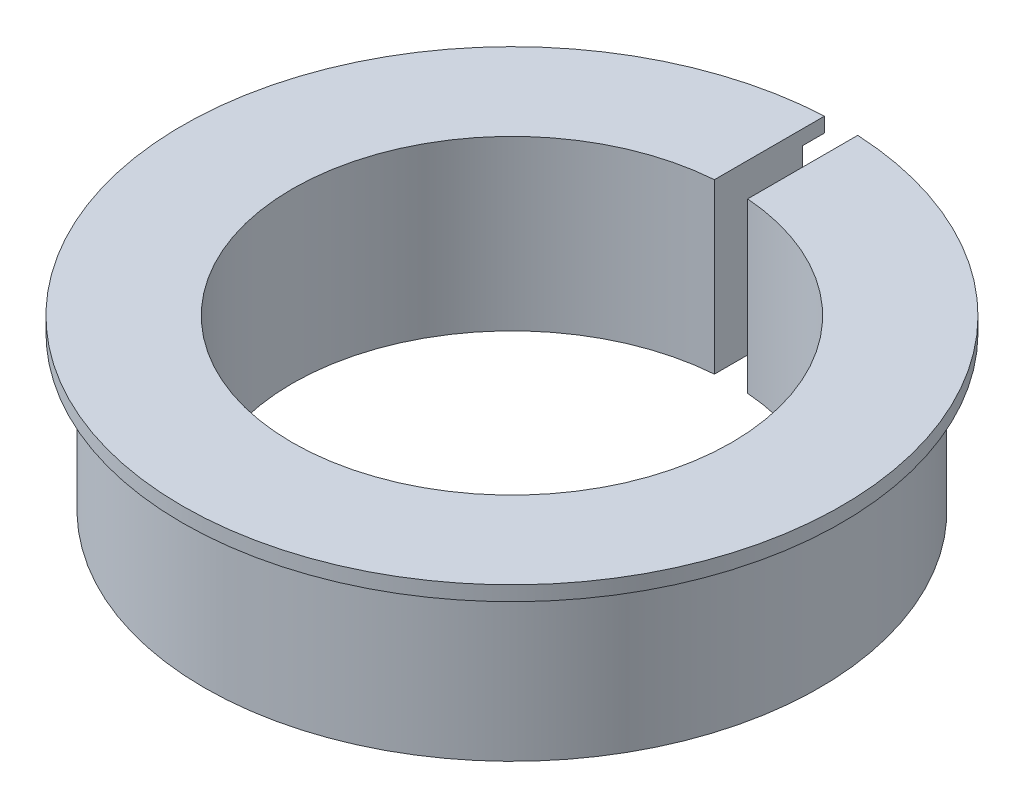
ISO-10303-21;
HEADER;
FILE_DESCRIPTION(('STEP AP214'),'2;1');
FILE_NAME('part.step','',(''),(''),'','','');
FILE_SCHEMA(('AUTOMOTIVE_DESIGN { 1 0 10303 214 1 1 1 1 }'));
ENDSEC;
DATA;
#1=APPLICATION_CONTEXT('core data for automotive mechanical design processes');
#2=APPLICATION_PROTOCOL_DEFINITION('international standard','automotive_design',2000,#1);
#3=PRODUCT_CONTEXT('',#1,'mechanical');
#4=PRODUCT('Part','Part','',(#3));
#5=PRODUCT_RELATED_PRODUCT_CATEGORY('part','',(#4));
#6=PRODUCT_DEFINITION_FORMATION('','',#4);
#7=PRODUCT_DEFINITION_CONTEXT('part definition',#1,'design');
#8=PRODUCT_DEFINITION('design','',#6,#7);
#9=PRODUCT_DEFINITION_SHAPE('','',#8);
#10=(LENGTH_UNIT() NAMED_UNIT(*) SI_UNIT(.MILLI.,.METRE.));
#11=(NAMED_UNIT(*) PLANE_ANGLE_UNIT() SI_UNIT($,.RADIAN.));
#12=(NAMED_UNIT(*) SI_UNIT($,.STERADIAN.) SOLID_ANGLE_UNIT());
#13=UNCERTAINTY_MEASURE_WITH_UNIT(LENGTH_MEASURE(1.E-05),#10,'distance_accuracy_value','');
#14=(GEOMETRIC_REPRESENTATION_CONTEXT(3) GLOBAL_UNCERTAINTY_ASSIGNED_CONTEXT((#13)) GLOBAL_UNIT_ASSIGNED_CONTEXT((#10,
#11,#12)) REPRESENTATION_CONTEXT('',''));
#15=CARTESIAN_POINT('',(0.,0.,0.));
#16=DIRECTION('',(0.,0.,1.));
#17=DIRECTION('',(1.,0.,0.));
#18=AXIS2_PLACEMENT_3D('',#15,#16,#17);
#19=CARTESIAN_POINT('',(0.,21.,0.));
#20=DIRECTION('',(0.,-1.,0.));
#21=DIRECTION('',(0.,0.,-1.));
#22=AXIS2_PLACEMENT_3D('',#19,#20,#21);
#23=CYLINDRICAL_SURFACE('',#22,42.);
#24=CARTESIAN_POINT('',(0.,0.,0.));
#25=DIRECTION('',(0.,1.,0.));
#26=DIRECTION('',(0.,0.,1.));
#27=AXIS2_PLACEMENT_3D('',#24,#25,#26);
#28=CIRCLE('',#27,42.);
#29=CARTESIAN_POINT('',(-2.26543034293681,0.,-41.9388581790361));
#30=VERTEX_POINT('',#29);
#31=CARTESIAN_POINT('',(2.27422361505894,0.,-41.9383822643257));
#32=VERTEX_POINT('',#31);
#33=EDGE_CURVE('E93',#30,#32,#28,.T.);
#34=ORIENTED_EDGE('',*,*,#33,.T.);
#35=DIRECTION('',(0.,-1.,0.));
#36=VECTOR('',#35,1.);
#37=CARTESIAN_POINT('',(2.27422361505894,21.,-41.9383822643257));
#38=LINE('',#37,#36);
#39=CARTESIAN_POINT('',(2.27422361505894,21.,-41.9383822643257));
#40=VERTEX_POINT('',#39);
#41=EDGE_CURVE('E11',#40,#32,#38,.T.);
#42=ORIENTED_EDGE('',*,*,#41,.F.);
#43=CARTESIAN_POINT('',(0.,21.,0.));
#44=DIRECTION('',(0.,1.,0.));
#45=DIRECTION('',(0.,0.,1.));
#46=AXIS2_PLACEMENT_3D('',#43,#44,#45);
#47=CIRCLE('',#46,42.);
#48=CARTESIAN_POINT('',(-2.26543034293681,21.,-41.9388581790361));
#49=VERTEX_POINT('',#48);
#50=EDGE_CURVE('E87',#49,#40,#47,.T.);
#51=ORIENTED_EDGE('',*,*,#50,.F.);
#52=DIRECTION('',(0.,-1.,0.));
#53=VECTOR('',#52,1.);
#54=CARTESIAN_POINT('',(-2.26543034293681,21.,-41.9388581790361));
#55=LINE('',#54,#53);
#56=EDGE_CURVE('E59',#49,#30,#55,.T.);
#57=ORIENTED_EDGE('',*,*,#56,.T.);
#58=EDGE_LOOP('',(#34,#42,#51,#57));
#59=FACE_BOUND('',#58,.T.);
#60=ADVANCED_FACE('F33',(#59),#23,.T.);
#61=CARTESIAN_POINT('',(2.27422361505894,21.,-29.9143414662817));
#62=DIRECTION('',(1.,0.,0.));
#63=DIRECTION('',(0.,0.,-1.));
#64=AXIS2_PLACEMENT_3D('',#61,#62,#63);
#65=PLANE('',#64);
#66=DIRECTION('',(0.,0.,1.));
#67=VECTOR('',#66,1.);
#68=CARTESIAN_POINT('',(2.27422361505894,0.,-29.9143414662817));
#69=LINE('',#68,#67);
#70=CARTESIAN_POINT('',(2.27422361505894,0.,-29.9143414662817));
#71=VERTEX_POINT('',#70);
#72=EDGE_CURVE('E100',#32,#71,#69,.T.);
#73=ORIENTED_EDGE('',*,*,#72,.T.);
#74=DIRECTION('',(0.,-1.,0.));
#75=VECTOR('',#74,1.);
#76=CARTESIAN_POINT('',(2.27422361505894,21.,-29.9143414662817));
#77=LINE('',#76,#75);
#78=CARTESIAN_POINT('',(2.27418578990196,21.,-29.9138439274053));
#79=VERTEX_POINT('',#78);
#80=EDGE_CURVE('E42',#79,#71,#77,.T.);
#81=ORIENTED_EDGE('',*,*,#80,.F.);
#82=CARTESIAN_POINT('',(2.27417318151629,23.,-29.9136780811132));
#83=DIRECTION('',(0.,-1.,0.));
#84=VECTOR('',#83,1.);
#85=LINE('',#82,#84);
#86=CARTESIAN_POINT('',(2.27419839828762,23.,-29.9140097736974));
#87=VERTEX_POINT('',#86);
#88=EDGE_CURVE('E132',#87,#79,#85,.T.);
#89=ORIENTED_EDGE('',*,*,#88,.F.);
#90=DIRECTION('',(0.,0.,-1.));
#91=VECTOR('',#90,1.);
#92=CARTESIAN_POINT('',(2.27422361505894,23.,0.));
#93=LINE('',#92,#91);
#94=CARTESIAN_POINT('',(2.27422361505894,23.,-44.9424955576424));
#95=VERTEX_POINT('',#94);
#96=EDGE_CURVE('E210',#87,#95,#93,.T.);
#97=ORIENTED_EDGE('',*,*,#96,.T.);
#98=DIRECTION('',(0.,-1.,0.));
#99=VECTOR('',#98,1.);
#100=CARTESIAN_POINT('',(2.27422361505894,23.,-44.9424955576424));
#101=LINE('',#100,#99);
#102=CARTESIAN_POINT('',(2.27422361505894,21.,-44.9424955576424));
#103=VERTEX_POINT('',#102);
#104=EDGE_CURVE('E106',#95,#103,#101,.T.);
#105=ORIENTED_EDGE('',*,*,#104,.T.);
#106=DIRECTION('',(0.,0.,-1.));
#107=VECTOR('',#106,1.);
#108=CARTESIAN_POINT('',(2.27422361505894,21.,0.));
#109=LINE('',#108,#107);
#110=EDGE_CURVE('E194',#40,#103,#109,.T.);
#111=ORIENTED_EDGE('',*,*,#110,.F.);
#112=ORIENTED_EDGE('',*,*,#41,.T.);
#113=EDGE_LOOP('',(#73,#81,#89,#97,#105,#111,#112));
#114=FACE_BOUND('',#113,.T.);
#115=ADVANCED_FACE('F149',(#114),#65,.F.);
#116=CARTESIAN_POINT('',(2.26543034293684,21.,-29.9143414662817));
#117=DIRECTION('',(0.,0.,1.));
#118=DIRECTION('',(1.,0.,0.));
#119=AXIS2_PLACEMENT_3D('',#116,#117,#118);
#120=PLANE('',#119);
#121=DIRECTION('',(-1.,0.,0.));
#122=VECTOR('',#121,1.);
#123=CARTESIAN_POINT('',(2.26543034293684,0.,-29.9143414662817));
#124=LINE('',#123,#122);
#125=CARTESIAN_POINT('',(2.26543034293684,0.,-29.9143414662817));
#126=VERTEX_POINT('',#125);
#127=EDGE_CURVE('E103',#71,#126,#124,.T.);
#128=ORIENTED_EDGE('',*,*,#127,.T.);
#129=DIRECTION('',(0.,-1.,0.));
#130=VECTOR('',#129,1.);
#131=CARTESIAN_POINT('',(2.26543034293684,21.,-29.9143414662817));
#132=LINE('',#131,#130);
#133=CARTESIAN_POINT('',(2.26543034293684,21.,-29.9143414662817));
#134=VERTEX_POINT('',#133);
#135=EDGE_CURVE('E115',#134,#126,#132,.T.);
#136=ORIENTED_EDGE('',*,*,#135,.F.);
#137=DIRECTION('',(-1.,0.,0.));
#138=VECTOR('',#137,1.);
#139=CARTESIAN_POINT('',(2.26543034293684,21.,-29.9143414662817));
#140=LINE('',#139,#138);
#141=EDGE_CURVE('E50',#79,#134,#140,.T.);
#142=ORIENTED_EDGE('',*,*,#141,.F.);
#143=ORIENTED_EDGE('',*,*,#80,.T.);
#144=EDGE_LOOP('',(#128,#136,#142,#143));
#145=FACE_BOUND('',#144,.T.);
#146=ADVANCED_FACE('F146',(#145),#120,.F.);
#147=CARTESIAN_POINT('',(0.,21.,0.));
#148=DIRECTION('',(0.,-1.,0.));
#149=DIRECTION('',(0.,0.,-1.));
#150=AXIS2_PLACEMENT_3D('',#147,#148,#149);
#151=CYLINDRICAL_SURFACE('',#150,30.);
#152=CARTESIAN_POINT('',(0.,0.,0.));
#153=DIRECTION('',(0.,-1.,0.));
#154=DIRECTION('',(0.,0.,1.));
#155=AXIS2_PLACEMENT_3D('',#152,#153,#154);
#156=CIRCLE('',#155,30.);
#157=CARTESIAN_POINT('',(-2.2654303429368,0.,-29.9143414662817));
#158=VERTEX_POINT('',#157);
#159=EDGE_CURVE('E88',#126,#158,#156,.T.);
#160=ORIENTED_EDGE('',*,*,#159,.T.);
#161=DIRECTION('',(0.,-1.,0.));
#162=VECTOR('',#161,1.);
#163=CARTESIAN_POINT('',(-2.2654303429368,21.,-29.9143414662817));
#164=LINE('',#163,#162);
#165=CARTESIAN_POINT('',(-2.26543034293681,23.,-29.9143414662817));
#166=VERTEX_POINT('',#165);
#167=EDGE_CURVE('E83',#166,#158,#164,.T.);
#168=ORIENTED_EDGE('',*,*,#167,.F.);
#169=CARTESIAN_POINT('',(0.,23.,0.));
#170=DIRECTION('',(0.,1.,0.));
#171=DIRECTION('',(0.,0.,1.));
#172=AXIS2_PLACEMENT_3D('',#169,#170,#171);
#173=CIRCLE('',#172,30.);
#174=EDGE_CURVE('E191',#87,#166,#173,.F.);
#175=ORIENTED_EDGE('',*,*,#174,.F.);
#176=ORIENTED_EDGE('',*,*,#88,.T.);
#177=CARTESIAN_POINT('',(0.,21.,0.));
#178=DIRECTION('',(0.,-1.,0.));
#179=DIRECTION('',(0.,0.,1.));
#180=AXIS2_PLACEMENT_3D('',#177,#178,#179);
#181=CIRCLE('',#180,30.);
#182=EDGE_CURVE('E96',#134,#79,#181,.T.);
#183=ORIENTED_EDGE('',*,*,#182,.F.);
#184=ORIENTED_EDGE('',*,*,#135,.T.);
#185=EDGE_LOOP('',(#160,#168,#175,#176,#183,#184));
#186=FACE_BOUND('',#185,.T.);
#187=ADVANCED_FACE('F136',(#186),#151,.F.);
#188=CARTESIAN_POINT('',(-2.26543034293681,21.,-29.9143414662817));
#189=DIRECTION('',(-1.,0.,0.));
#190=DIRECTION('',(0.,0.,1.));
#191=AXIS2_PLACEMENT_3D('',#188,#189,#190);
#192=PLANE('',#191);
#193=DIRECTION('',(0.,0.,-1.));
#194=VECTOR('',#193,1.);
#195=CARTESIAN_POINT('',(-2.26543034293681,0.,-29.9143414662817));
#196=LINE('',#195,#194);
#197=EDGE_CURVE('E79',#158,#30,#196,.T.);
#198=ORIENTED_EDGE('',*,*,#197,.T.);
#199=ORIENTED_EDGE('',*,*,#56,.F.);
#200=DIRECTION('',(0.,0.,-1.));
#201=VECTOR('',#200,1.);
#202=CARTESIAN_POINT('',(-2.2654303429368,21.,0.));
#203=LINE('',#202,#201);
#204=CARTESIAN_POINT('',(-2.2654303429368,21.,-44.9429396608778));
#205=VERTEX_POINT('',#204);
#206=EDGE_CURVE('E197',#49,#205,#203,.T.);
#207=ORIENTED_EDGE('',*,*,#206,.T.);
#208=DIRECTION('',(0.,-1.,0.));
#209=VECTOR('',#208,1.);
#210=CARTESIAN_POINT('',(-2.2654303429368,23.,-44.9429396608778));
#211=LINE('',#210,#209);
#212=CARTESIAN_POINT('',(-2.2654303429368,23.,-44.9429396608778));
#213=VERTEX_POINT('',#212);
#214=EDGE_CURVE('E101',#213,#205,#211,.T.);
#215=ORIENTED_EDGE('',*,*,#214,.F.);
#216=DIRECTION('',(0.,0.,-1.));
#217=VECTOR('',#216,1.);
#218=CARTESIAN_POINT('',(-2.2654303429368,23.,0.));
#219=LINE('',#218,#217);
#220=EDGE_CURVE('E184',#166,#213,#219,.T.);
#221=ORIENTED_EDGE('',*,*,#220,.F.);
#222=ORIENTED_EDGE('',*,*,#167,.T.);
#223=EDGE_LOOP('',(#198,#199,#207,#215,#221,#222));
#224=FACE_BOUND('',#223,.T.);
#225=ADVANCED_FACE('F80',(#224),#192,.F.);
#226=CARTESIAN_POINT('',(0.,21.,0.));
#227=DIRECTION('',(0.,1.,0.));
#228=DIRECTION('',(0.,0.,1.));
#229=AXIS2_PLACEMENT_3D('',#226,#227,#228);
#230=PLANE('',#229);
#231=ORIENTED_EDGE('',*,*,#182,.T.);
#232=ORIENTED_EDGE('',*,*,#141,.T.);
#233=EDGE_LOOP('',(#231,#232));
#234=FACE_BOUND('',#233,.T.);
#235=ADVANCED_FACE('F160',(#234),#230,.T.);
#236=CARTESIAN_POINT('',(0.,0.,0.));
#237=DIRECTION('',(0.,1.,0.));
#238=DIRECTION('',(0.,0.,1.));
#239=AXIS2_PLACEMENT_3D('',#236,#237,#238);
#240=PLANE('',#239);
#241=ORIENTED_EDGE('',*,*,#33,.F.);
#242=ORIENTED_EDGE('',*,*,#197,.F.);
#243=ORIENTED_EDGE('',*,*,#159,.F.);
#244=ORIENTED_EDGE('',*,*,#127,.F.);
#245=ORIENTED_EDGE('',*,*,#72,.F.);
#246=EDGE_LOOP('',(#241,#242,#243,#244,#245));
#247=FACE_BOUND('',#246,.T.);
#248=ADVANCED_FACE('F98',(#247),#240,.F.);
#249=CARTESIAN_POINT('',(0.,21.,0.));
#250=DIRECTION('',(0.,1.,0.));
#251=DIRECTION('',(0.,0.,1.));
#252=AXIS2_PLACEMENT_3D('',#249,#250,#251);
#253=PLANE('',#252);
#254=ORIENTED_EDGE('',*,*,#206,.F.);
#255=ORIENTED_EDGE('',*,*,#50,.T.);
#256=ORIENTED_EDGE('',*,*,#110,.T.);
#257=CARTESIAN_POINT('',(0.,21.,0.));
#258=DIRECTION('',(0.,1.,0.));
#259=DIRECTION('',(0.,0.,1.));
#260=AXIS2_PLACEMENT_3D('',#257,#258,#259);
#261=CIRCLE('',#260,45.);
#262=EDGE_CURVE('E200',#205,#103,#261,.T.);
#263=ORIENTED_EDGE('',*,*,#262,.F.);
#264=EDGE_LOOP('',(#254,#255,#256,#263));
#265=FACE_BOUND('',#264,.T.);
#266=ADVANCED_FACE('F167',(#265),#253,.F.);
#267=CARTESIAN_POINT('',(0.,23.,0.));
#268=DIRECTION('',(0.,-1.,0.));
#269=DIRECTION('',(0.,0.,-1.));
#270=AXIS2_PLACEMENT_3D('',#267,#268,#269);
#271=CYLINDRICAL_SURFACE('',#270,45.);
#272=ORIENTED_EDGE('',*,*,#262,.T.);
#273=ORIENTED_EDGE('',*,*,#104,.F.);
#274=CARTESIAN_POINT('',(0.,23.,0.));
#275=DIRECTION('',(0.,1.,0.));
#276=DIRECTION('',(0.,0.,1.));
#277=AXIS2_PLACEMENT_3D('',#274,#275,#276);
#278=CIRCLE('',#277,45.);
#279=EDGE_CURVE('E189',#213,#95,#278,.T.);
#280=ORIENTED_EDGE('',*,*,#279,.F.);
#281=ORIENTED_EDGE('',*,*,#214,.T.);
#282=EDGE_LOOP('',(#272,#273,#280,#281));
#283=FACE_BOUND('',#282,.T.);
#284=ADVANCED_FACE('F169',(#283),#271,.T.);
#285=CARTESIAN_POINT('',(0.,23.,0.));
#286=DIRECTION('',(0.,1.,0.));
#287=DIRECTION('',(0.,0.,1.));
#288=AXIS2_PLACEMENT_3D('',#285,#286,#287);
#289=PLANE('',#288);
#290=ORIENTED_EDGE('',*,*,#220,.T.);
#291=ORIENTED_EDGE('',*,*,#279,.T.);
#292=ORIENTED_EDGE('',*,*,#96,.F.);
#293=ORIENTED_EDGE('',*,*,#174,.T.);
#294=EDGE_LOOP('',(#290,#291,#292,#293));
#295=FACE_BOUND('',#294,.T.);
#296=ADVANCED_FACE('F172',(#295),#289,.T.);
#297=CLOSED_SHELL('',(#60,#115,#146,#187,#225,#235,#248,#266,#284,#296));
#298=MANIFOLD_SOLID_BREP('B2',#297);
#299=ADVANCED_BREP_SHAPE_REPRESENTATION('',(#18,#298),#14);
#300=SHAPE_DEFINITION_REPRESENTATION(#9,#299);
ENDSEC;
END-ISO-10303-21;
